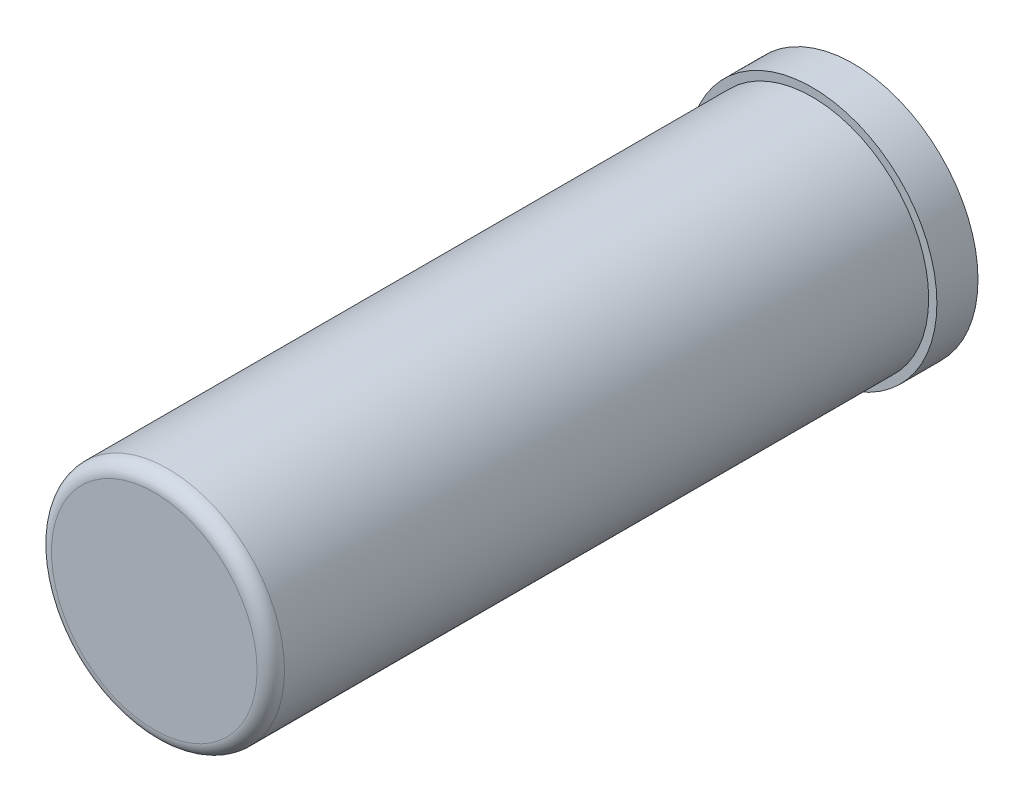
ISO-10303-21;
HEADER;
FILE_DESCRIPTION(('STEP AP214'),'2;1');
FILE_NAME('part.step','',(''),(''),'','','');
FILE_SCHEMA(('AUTOMOTIVE_DESIGN { 1 0 10303 214 1 1 1 1 }'));
ENDSEC;
DATA;
#1=APPLICATION_CONTEXT('core data for automotive mechanical design processes');
#2=APPLICATION_PROTOCOL_DEFINITION('international standard','automotive_design',2000,#1);
#3=PRODUCT_CONTEXT('',#1,'mechanical');
#4=PRODUCT('Part','Part','',(#3));
#5=PRODUCT_RELATED_PRODUCT_CATEGORY('part','',(#4));
#6=PRODUCT_DEFINITION_FORMATION('','',#4);
#7=PRODUCT_DEFINITION_CONTEXT('part definition',#1,'design');
#8=PRODUCT_DEFINITION('design','',#6,#7);
#9=PRODUCT_DEFINITION_SHAPE('','',#8);
#10=(LENGTH_UNIT() NAMED_UNIT(*) SI_UNIT(.MILLI.,.METRE.));
#11=(NAMED_UNIT(*) PLANE_ANGLE_UNIT() SI_UNIT($,.RADIAN.));
#12=(NAMED_UNIT(*) SI_UNIT($,.STERADIAN.) SOLID_ANGLE_UNIT());
#13=UNCERTAINTY_MEASURE_WITH_UNIT(LENGTH_MEASURE(1.E-05),#10,'distance_accuracy_value','');
#14=(GEOMETRIC_REPRESENTATION_CONTEXT(3) GLOBAL_UNCERTAINTY_ASSIGNED_CONTEXT((#13)) GLOBAL_UNIT_ASSIGNED_CONTEXT((#10,
#11,#12)) REPRESENTATION_CONTEXT('',''));
#15=CARTESIAN_POINT('',(0.,0.,0.));
#16=DIRECTION('',(0.,0.,1.));
#17=DIRECTION('',(1.,0.,0.));
#18=AXIS2_PLACEMENT_3D('',#15,#16,#17);
#19=CARTESIAN_POINT('',(0.,0.,0.));
#20=DIRECTION('',(0.,0.,1.));
#21=DIRECTION('',(1.,0.,0.));
#22=AXIS2_PLACEMENT_3D('',#19,#20,#21);
#23=PLANE('',#22);
#24=CARTESIAN_POINT('',(0.,0.,0.));
#25=DIRECTION('',(0.,0.,1.));
#26=DIRECTION('',(1.,0.,0.));
#27=AXIS2_PLACEMENT_3D('',#24,#25,#26);
#28=CIRCLE('',#27,23.8125);
#29=CARTESIAN_POINT('',(23.8125,0.,0.));
#30=VERTEX_POINT('',#29);
#31=EDGE_CURVE('E40',#30,#30,#28,.T.);
#32=ORIENTED_EDGE('',*,*,#31,.T.);
#33=EDGE_LOOP('',(#32));
#34=FACE_BOUND('',#33,.T.);
#35=ADVANCED_FACE('F32',(#34),#23,.T.);
#36=CARTESIAN_POINT('',(0.,0.,-155.575));
#37=DIRECTION('',(0.,0.,-1.));
#38=DIRECTION('',(-1.,0.,0.));
#39=AXIS2_PLACEMENT_3D('',#36,#37,#38);
#40=PLANE('',#39);
#41=CARTESIAN_POINT('',(0.,0.,-155.575));
#42=DIRECTION('',(0.,0.,1.));
#43=DIRECTION('',(1.,0.,0.));
#44=AXIS2_PLACEMENT_3D('',#41,#42,#43);
#45=CIRCLE('',#44,15.875);
#46=CARTESIAN_POINT('',(15.875,0.,-155.575));
#47=VERTEX_POINT('',#46);
#48=EDGE_CURVE('E65',#47,#47,#45,.T.);
#49=ORIENTED_EDGE('',*,*,#48,.F.);
#50=EDGE_LOOP('',(#49));
#51=FACE_BOUND('',#50,.T.);
#52=ADVANCED_FACE('F97',(#51),#40,.T.);
#53=CARTESIAN_POINT('',(0.,0.,0.));
#54=DIRECTION('',(0.,0.,1.));
#55=DIRECTION('',(1.,0.,0.));
#56=AXIS2_PLACEMENT_3D('',#53,#54,#55);
#57=CYLINDRICAL_SURFACE('',#56,15.875);
#58=ORIENTED_EDGE('',*,*,#48,.T.);
#59=EDGE_LOOP('',(#58));
#60=FACE_BOUND('',#59,.T.);
#61=CARTESIAN_POINT('',(0.,0.,-161.925));
#62=DIRECTION('',(0.,0.,1.));
#63=DIRECTION('',(1.,0.,0.));
#64=AXIS2_PLACEMENT_3D('',#61,#62,#63);
#65=CIRCLE('',#64,15.875);
#66=CARTESIAN_POINT('',(15.875,0.,-161.925));
#67=VERTEX_POINT('',#66);
#68=EDGE_CURVE('E68',#67,#67,#65,.T.);
#69=ORIENTED_EDGE('',*,*,#68,.F.);
#70=EDGE_LOOP('',(#69));
#71=FACE_BOUND('',#70,.T.);
#72=ADVANCED_FACE('F101',(#60,#71),#57,.F.);
#73=CARTESIAN_POINT('',(0.,0.,-161.925));
#74=DIRECTION('',(0.,0.,-1.));
#75=DIRECTION('',(-1.,0.,0.));
#76=AXIS2_PLACEMENT_3D('',#73,#74,#75);
#77=PLANE('',#76);
#78=ORIENTED_EDGE('',*,*,#68,.T.);
#79=EDGE_LOOP('',(#78));
#80=FACE_BOUND('',#79,.T.);
#81=CARTESIAN_POINT('',(0.,0.,-161.925));
#82=DIRECTION('',(0.,0.,1.));
#83=DIRECTION('',(1.,0.,0.));
#84=AXIS2_PLACEMENT_3D('',#81,#82,#83);
#85=CIRCLE('',#84,28.8925);
#86=CARTESIAN_POINT('',(28.8925,0.,-161.925));
#87=VERTEX_POINT('',#86);
#88=EDGE_CURVE('E71',#87,#87,#85,.T.);
#89=ORIENTED_EDGE('',*,*,#88,.F.);
#90=EDGE_LOOP('',(#89));
#91=FACE_BOUND('',#90,.T.);
#92=ADVANCED_FACE('F93',(#80,#91),#77,.T.);
#93=CARTESIAN_POINT('',(0.,0.,0.));
#94=DIRECTION('',(0.,0.,1.));
#95=DIRECTION('',(1.,0.,0.));
#96=AXIS2_PLACEMENT_3D('',#93,#94,#95);
#97=CYLINDRICAL_SURFACE('',#96,28.8925);
#98=ORIENTED_EDGE('',*,*,#88,.T.);
#99=EDGE_LOOP('',(#98));
#100=FACE_BOUND('',#99,.T.);
#101=CARTESIAN_POINT('',(0.,0.,-152.4));
#102=DIRECTION('',(0.,0.,1.));
#103=DIRECTION('',(1.,0.,0.));
#104=AXIS2_PLACEMENT_3D('',#101,#102,#103);
#105=CIRCLE('',#104,28.8925);
#106=CARTESIAN_POINT('',(28.8925,0.,-152.4));
#107=VERTEX_POINT('',#106);
#108=EDGE_CURVE('E74',#107,#107,#105,.T.);
#109=ORIENTED_EDGE('',*,*,#108,.F.);
#110=EDGE_LOOP('',(#109));
#111=FACE_BOUND('',#110,.T.);
#112=ADVANCED_FACE('F85',(#100,#111),#97,.T.);
#113=CARTESIAN_POINT('',(0.,0.,-152.4));
#114=DIRECTION('',(0.,0.,1.));
#115=DIRECTION('',(1.,0.,0.));
#116=AXIS2_PLACEMENT_3D('',#113,#114,#115);
#117=PLANE('',#116);
#118=ORIENTED_EDGE('',*,*,#108,.T.);
#119=EDGE_LOOP('',(#118));
#120=FACE_BOUND('',#119,.T.);
#121=CARTESIAN_POINT('',(0.,0.,-152.4));
#122=DIRECTION('',(0.,0.,1.));
#123=DIRECTION('',(1.,0.,0.));
#124=AXIS2_PLACEMENT_3D('',#121,#122,#123);
#125=CIRCLE('',#124,26.9875);
#126=CARTESIAN_POINT('',(26.9875,0.,-152.4));
#127=VERTEX_POINT('',#126);
#128=EDGE_CURVE('E77',#127,#127,#125,.T.);
#129=ORIENTED_EDGE('',*,*,#128,.F.);
#130=EDGE_LOOP('',(#129));
#131=FACE_BOUND('',#130,.T.);
#132=ADVANCED_FACE('F83',(#120,#131),#117,.T.);
#133=CARTESIAN_POINT('',(0.,0.,0.));
#134=DIRECTION('',(0.,0.,1.));
#135=DIRECTION('',(1.,0.,0.));
#136=AXIS2_PLACEMENT_3D('',#133,#134,#135);
#137=CYLINDRICAL_SURFACE('',#136,26.9875);
#138=CARTESIAN_POINT('',(0.,0.,-3.175));
#139=DIRECTION('',(0.,0.,1.));
#140=DIRECTION('',(1.,0.,0.));
#141=AXIS2_PLACEMENT_3D('',#138,#139,#140);
#142=CIRCLE('',#141,26.9875);
#143=CARTESIAN_POINT('',(26.9875,0.,-3.175));
#144=VERTEX_POINT('',#143);
#145=EDGE_CURVE('E10',#144,#144,#142,.F.);
#146=ORIENTED_EDGE('',*,*,#145,.T.);
#147=EDGE_LOOP('',(#146));
#148=FACE_BOUND('',#147,.T.);
#149=ORIENTED_EDGE('',*,*,#128,.T.);
#150=EDGE_LOOP('',(#149));
#151=FACE_BOUND('',#150,.T.);
#152=ADVANCED_FACE('F81',(#148,#151),#137,.T.);
#153=CARTESIAN_POINT('',(0.,0.,-3.175));
#154=DIRECTION('',(0.,0.,1.));
#155=DIRECTION('',(1.,0.,0.));
#156=AXIS2_PLACEMENT_3D('',#153,#154,#155);
#157=TOROIDAL_SURFACE('',#156,23.8125,3.175);
#158=ORIENTED_EDGE('',*,*,#145,.F.);
#159=EDGE_LOOP('',(#158));
#160=FACE_BOUND('',#159,.T.);
#161=ORIENTED_EDGE('',*,*,#31,.F.);
#162=EDGE_LOOP('',(#161));
#163=FACE_BOUND('',#162,.T.);
#164=ADVANCED_FACE('F34',(#160,#163),#157,.T.);
#165=CLOSED_SHELL('',(#35,#52,#72,#92,#112,#132,#152,#164));
#166=CARTESIAN_POINT('',(0.,0.,-3.175));
#167=DIRECTION('',(0.,0.,1.));
#168=DIRECTION('',(1.,0.,0.));
#169=AXIS2_PLACEMENT_3D('',#166,#167,#168);
#170=PLANE('',#169);
#171=CARTESIAN_POINT('',(0.,0.,-3.175));
#172=DIRECTION('',(0.,0.,1.));
#173=DIRECTION('',(1.,0.,0.));
#174=AXIS2_PLACEMENT_3D('',#171,#172,#173);
#175=CIRCLE('',#174,23.8125);
#176=CARTESIAN_POINT('',(23.8125,0.,-3.175));
#177=VERTEX_POINT('',#176);
#178=EDGE_CURVE('E44',#177,#177,#175,.T.);
#179=ORIENTED_EDGE('',*,*,#178,.F.);
#180=EDGE_LOOP('',(#179));
#181=FACE_BOUND('',#180,.T.);
#182=ADVANCED_FACE('F105',(#181),#170,.F.);
#183=CARTESIAN_POINT('',(0.,0.,0.));
#184=DIRECTION('',(0.,0.,1.));
#185=DIRECTION('',(1.,0.,0.));
#186=AXIS2_PLACEMENT_3D('',#183,#184,#185);
#187=CYLINDRICAL_SURFACE('',#186,23.8125);
#188=CARTESIAN_POINT('',(0.,0.,-155.575));
#189=DIRECTION('',(0.,0.,1.));
#190=DIRECTION('',(1.,0.,0.));
#191=AXIS2_PLACEMENT_3D('',#188,#189,#190);
#192=CIRCLE('',#191,23.8125);
#193=CARTESIAN_POINT('',(23.8125,0.,-155.575));
#194=VERTEX_POINT('',#193);
#195=EDGE_CURVE('E48',#194,#194,#192,.T.);
#196=ORIENTED_EDGE('',*,*,#195,.F.);
#197=EDGE_LOOP('',(#196));
#198=FACE_BOUND('',#197,.T.);
#199=ORIENTED_EDGE('',*,*,#178,.T.);
#200=EDGE_LOOP('',(#199));
#201=FACE_BOUND('',#200,.T.);
#202=ADVANCED_FACE('F108',(#198,#201),#187,.F.);
#203=CARTESIAN_POINT('',(0.,0.,-155.575));
#204=DIRECTION('',(0.,0.,1.));
#205=DIRECTION('',(1.,0.,0.));
#206=AXIS2_PLACEMENT_3D('',#203,#204,#205);
#207=PLANE('',#206);
#208=CARTESIAN_POINT('',(0.,0.,-155.575));
#209=DIRECTION('',(0.,0.,1.));
#210=DIRECTION('',(1.,0.,0.));
#211=AXIS2_PLACEMENT_3D('',#208,#209,#210);
#212=CIRCLE('',#211,25.7175);
#213=CARTESIAN_POINT('',(25.7175,0.,-155.575));
#214=VERTEX_POINT('',#213);
#215=EDGE_CURVE('E53',#214,#214,#212,.T.);
#216=ORIENTED_EDGE('',*,*,#215,.F.);
#217=EDGE_LOOP('',(#216));
#218=FACE_BOUND('',#217,.T.);
#219=ORIENTED_EDGE('',*,*,#195,.T.);
#220=EDGE_LOOP('',(#219));
#221=FACE_BOUND('',#220,.T.);
#222=ADVANCED_FACE('F113',(#218,#221),#207,.F.);
#223=CARTESIAN_POINT('',(0.,0.,0.));
#224=DIRECTION('',(0.,0.,1.));
#225=DIRECTION('',(1.,0.,0.));
#226=AXIS2_PLACEMENT_3D('',#223,#224,#225);
#227=CYLINDRICAL_SURFACE('',#226,25.7175);
#228=CARTESIAN_POINT('',(0.,0.,-158.75));
#229=DIRECTION('',(0.,0.,1.));
#230=DIRECTION('',(1.,0.,0.));
#231=AXIS2_PLACEMENT_3D('',#228,#229,#230);
#232=CIRCLE('',#231,25.7175);
#233=CARTESIAN_POINT('',(25.7175,0.,-158.75));
#234=VERTEX_POINT('',#233);
#235=EDGE_CURVE('E56',#234,#234,#232,.T.);
#236=ORIENTED_EDGE('',*,*,#235,.F.);
#237=EDGE_LOOP('',(#236));
#238=FACE_BOUND('',#237,.T.);
#239=ORIENTED_EDGE('',*,*,#215,.T.);
#240=EDGE_LOOP('',(#239));
#241=FACE_BOUND('',#240,.T.);
#242=ADVANCED_FACE('F117',(#238,#241),#227,.F.);
#243=CARTESIAN_POINT('',(0.,0.,-158.75));
#244=DIRECTION('',(0.,0.,-1.));
#245=DIRECTION('',(-1.,0.,0.));
#246=AXIS2_PLACEMENT_3D('',#243,#244,#245);
#247=PLANE('',#246);
#248=CARTESIAN_POINT('',(0.,0.,-158.75));
#249=DIRECTION('',(0.,0.,1.));
#250=DIRECTION('',(1.,0.,0.));
#251=AXIS2_PLACEMENT_3D('',#248,#249,#250);
#252=CIRCLE('',#251,19.05);
#253=CARTESIAN_POINT('',(19.05,0.,-158.75));
#254=VERTEX_POINT('',#253);
#255=EDGE_CURVE('E59',#254,#254,#252,.T.);
#256=ORIENTED_EDGE('',*,*,#255,.F.);
#257=EDGE_LOOP('',(#256));
#258=FACE_BOUND('',#257,.T.);
#259=ORIENTED_EDGE('',*,*,#235,.T.);
#260=EDGE_LOOP('',(#259));
#261=FACE_BOUND('',#260,.T.);
#262=ADVANCED_FACE('F121',(#258,#261),#247,.F.);
#263=CARTESIAN_POINT('',(0.,0.,0.));
#264=DIRECTION('',(0.,0.,1.));
#265=DIRECTION('',(1.,0.,0.));
#266=AXIS2_PLACEMENT_3D('',#263,#264,#265);
#267=CYLINDRICAL_SURFACE('',#266,19.05);
#268=CARTESIAN_POINT('',(0.,0.,-152.4));
#269=DIRECTION('',(0.,0.,1.));
#270=DIRECTION('',(1.,0.,0.));
#271=AXIS2_PLACEMENT_3D('',#268,#269,#270);
#272=CIRCLE('',#271,19.05);
#273=CARTESIAN_POINT('',(19.05,0.,-152.4));
#274=VERTEX_POINT('',#273);
#275=EDGE_CURVE('E62',#274,#274,#272,.T.);
#276=ORIENTED_EDGE('',*,*,#275,.F.);
#277=EDGE_LOOP('',(#276));
#278=FACE_BOUND('',#277,.T.);
#279=ORIENTED_EDGE('',*,*,#255,.T.);
#280=EDGE_LOOP('',(#279));
#281=FACE_BOUND('',#280,.T.);
#282=ADVANCED_FACE('F125',(#278,#281),#267,.T.);
#283=CARTESIAN_POINT('',(0.,0.,-152.4));
#284=DIRECTION('',(0.,0.,-1.));
#285=DIRECTION('',(-1.,0.,0.));
#286=AXIS2_PLACEMENT_3D('',#283,#284,#285);
#287=PLANE('',#286);
#288=ORIENTED_EDGE('',*,*,#275,.T.);
#289=EDGE_LOOP('',(#288));
#290=FACE_BOUND('',#289,.T.);
#291=ADVANCED_FACE('F129',(#290),#287,.F.);
#292=CLOSED_SHELL('',(#182,#202,#222,#242,#262,#282,#291));
#293=ORIENTED_CLOSED_SHELL('',*,#292,.T.);
#294=BREP_WITH_VOIDS('B2',#165,(#293));
#295=ADVANCED_BREP_SHAPE_REPRESENTATION('',(#18,#294),#14);
#296=SHAPE_DEFINITION_REPRESENTATION(#9,#295);
ENDSEC;
END-ISO-10303-21;
